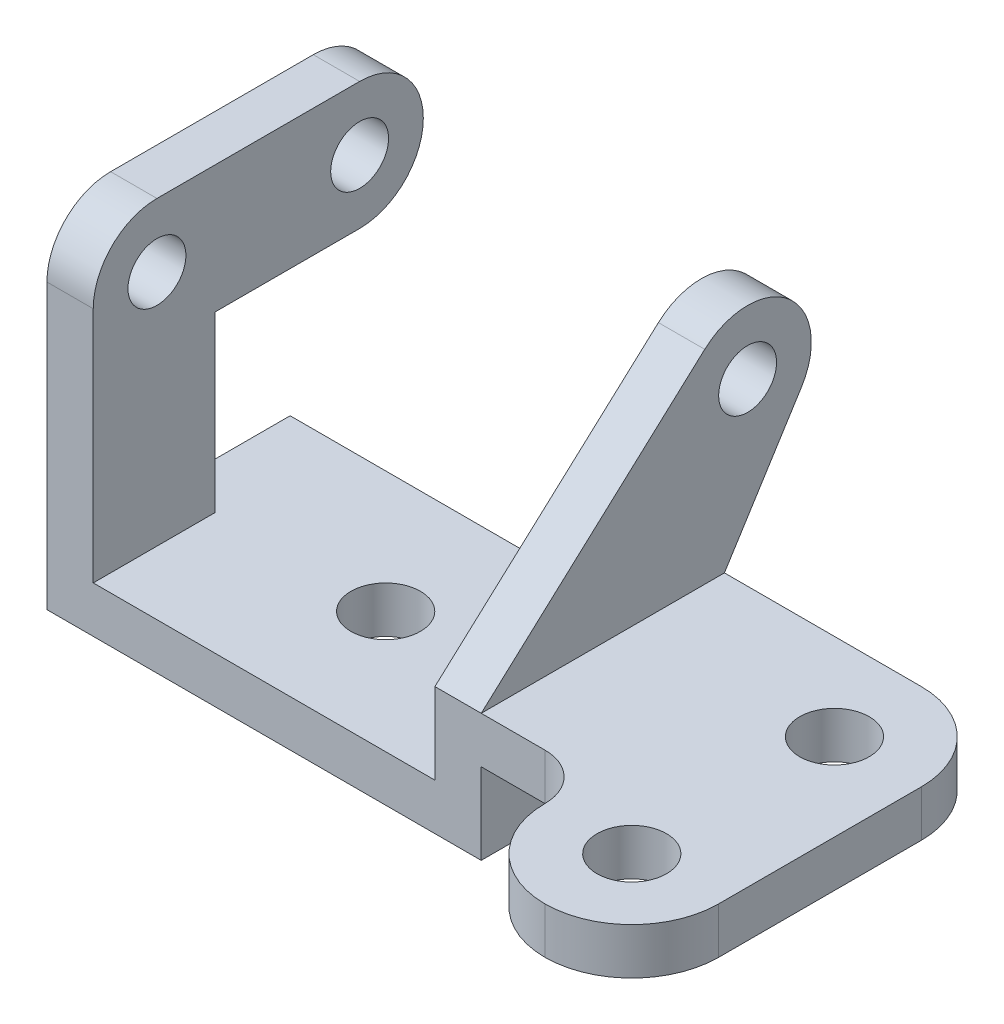
ISO-10303-21;
HEADER;
FILE_DESCRIPTION(('STEP AP214'),'2;1');
FILE_NAME('part.step','',(''),(''),'','','');
FILE_SCHEMA(('AUTOMOTIVE_DESIGN { 1 0 10303 214 1 1 1 1 }'));
ENDSEC;
DATA;
#1=APPLICATION_CONTEXT('core data for automotive mechanical design processes');
#2=APPLICATION_PROTOCOL_DEFINITION('international standard','automotive_design',2000,#1);
#3=PRODUCT_CONTEXT('',#1,'mechanical');
#4=PRODUCT('Part','Part','',(#3));
#5=PRODUCT_RELATED_PRODUCT_CATEGORY('part','',(#4));
#6=PRODUCT_DEFINITION_FORMATION('','',#4);
#7=PRODUCT_DEFINITION_CONTEXT('part definition',#1,'design');
#8=PRODUCT_DEFINITION('design','',#6,#7);
#9=PRODUCT_DEFINITION_SHAPE('','',#8);
#10=(LENGTH_UNIT() NAMED_UNIT(*) SI_UNIT(.MILLI.,.METRE.));
#11=(NAMED_UNIT(*) PLANE_ANGLE_UNIT() SI_UNIT($,.RADIAN.));
#12=(NAMED_UNIT(*) SI_UNIT($,.STERADIAN.) SOLID_ANGLE_UNIT());
#13=UNCERTAINTY_MEASURE_WITH_UNIT(LENGTH_MEASURE(1.E-05),#10,'distance_accuracy_value','');
#14=(GEOMETRIC_REPRESENTATION_CONTEXT(3) GLOBAL_UNCERTAINTY_ASSIGNED_CONTEXT((#13)) GLOBAL_UNIT_ASSIGNED_CONTEXT((#10,
#11,#12)) REPRESENTATION_CONTEXT('',''));
#15=CARTESIAN_POINT('',(0.,0.,0.));
#16=DIRECTION('',(0.,0.,1.));
#17=DIRECTION('',(1.,0.,0.));
#18=AXIS2_PLACEMENT_3D('',#15,#16,#17);
#19=CARTESIAN_POINT('',(-75.,120.,0.));
#20=DIRECTION('',(0.,0.,1.));
#21=DIRECTION('',(1.,0.,0.));
#22=AXIS2_PLACEMENT_3D('',#19,#20,#21);
#23=PLANE('',#22);
#24=DIRECTION('',(-1.,0.,0.));
#25=VECTOR('',#24,1.);
#26=CARTESIAN_POINT('',(-59.,76.,0.));
#27=LINE('',#26,#25);
#28=CARTESIAN_POINT('',(-59.,76.,0.));
#29=VERTEX_POINT('',#28);
#30=CARTESIAN_POINT('',(-75.,76.,0.));
#31=VERTEX_POINT('',#30);
#32=EDGE_CURVE('E207',#29,#31,#27,.T.);
#33=ORIENTED_EDGE('',*,*,#32,.F.);
#34=DIRECTION('',(0.,-1.,0.));
#35=VECTOR('',#34,1.);
#36=CARTESIAN_POINT('',(-59.,120.,0.));
#37=LINE('',#36,#35);
#38=CARTESIAN_POINT('',(-59.,16.,0.));
#39=VERTEX_POINT('',#38);
#40=EDGE_CURVE('E219',#29,#39,#37,.T.);
#41=ORIENTED_EDGE('',*,*,#40,.T.);
#42=DIRECTION('',(-1.,0.,0.));
#43=VECTOR('',#42,1.);
#44=CARTESIAN_POINT('',(-75.,16.,0.));
#45=LINE('',#44,#43);
#46=CARTESIAN_POINT('',(-75.,16.,0.));
#47=VERTEX_POINT('',#46);
#48=EDGE_CURVE('E603',#39,#47,#45,.T.);
#49=ORIENTED_EDGE('',*,*,#48,.T.);
#50=DIRECTION('',(0.,-1.,0.));
#51=VECTOR('',#50,1.);
#52=CARTESIAN_POINT('',(-75.,120.,0.));
#53=LINE('',#52,#51);
#54=EDGE_CURVE('E221',#31,#47,#53,.T.);
#55=ORIENTED_EDGE('',*,*,#54,.F.);
#56=EDGE_LOOP('',(#33,#41,#49,#55));
#57=FACE_BOUND('',#56,.T.);
#58=ADVANCED_FACE('F57',(#57),#23,.F.);
#59=CARTESIAN_POINT('',(0.,16.,0.));
#60=DIRECTION('',(0.,-1.,0.));
#61=DIRECTION('',(0.,0.,-1.));
#62=AXIS2_PLACEMENT_3D('',#59,#60,#61);
#63=PLANE('',#62);
#64=CARTESIAN_POINT('',(0.,16.,0.));
#65=DIRECTION('',(0.,1.,0.));
#66=DIRECTION('',(0.,0.,1.));
#67=AXIS2_PLACEMENT_3D('',#64,#65,#66);
#68=CIRCLE('',#67,12.);
#69=CARTESIAN_POINT('',(0.,16.,12.));
#70=VERTEX_POINT('',#69);
#71=EDGE_CURVE('E343',#70,#70,#68,.T.);
#72=ORIENTED_EDGE('',*,*,#71,.F.);
#73=EDGE_LOOP('',(#72));
#74=FACE_BOUND('',#73,.T.);
#75=DIRECTION('',(0.,0.,-1.));
#76=VECTOR('',#75,1.);
#77=CARTESIAN_POINT('',(-59.,16.,42.));
#78=LINE('',#77,#76);
#79=CARTESIAN_POINT('',(-59.,16.,42.));
#80=VERTEX_POINT('',#79);
#81=EDGE_CURVE('E228',#80,#39,#78,.T.);
#82=ORIENTED_EDGE('',*,*,#81,.F.);
#83=DIRECTION('',(1.,0.,0.));
#84=VECTOR('',#83,1.);
#85=CARTESIAN_POINT('',(-75.,16.,42.));
#86=LINE('',#85,#84);
#87=CARTESIAN_POINT('',(59.,16.,42.));
#88=VERTEX_POINT('',#87);
#89=EDGE_CURVE('E359',#80,#88,#86,.T.);
#90=ORIENTED_EDGE('',*,*,#89,.T.);
#91=DIRECTION('',(0.,0.,1.));
#92=VECTOR('',#91,1.);
#93=CARTESIAN_POINT('',(59.,16.,42.));
#94=LINE('',#93,#92);
#95=CARTESIAN_POINT('',(59.,16.,-42.));
#96=VERTEX_POINT('',#95);
#97=EDGE_CURVE('E321',#96,#88,#94,.T.);
#98=ORIENTED_EDGE('',*,*,#97,.F.);
#99=DIRECTION('',(-1.,0.,0.));
#100=VECTOR('',#99,1.);
#101=CARTESIAN_POINT('',(-75.,16.,-42.));
#102=LINE('',#101,#100);
#103=CARTESIAN_POINT('',(-75.,16.,-42.));
#104=VERTEX_POINT('',#103);
#105=EDGE_CURVE('E351',#96,#104,#102,.T.);
#106=ORIENTED_EDGE('',*,*,#105,.T.);
#107=DIRECTION('',(0.,0.,1.));
#108=VECTOR('',#107,1.);
#109=CARTESIAN_POINT('',(-75.,16.,42.));
#110=LINE('',#109,#108);
#111=EDGE_CURVE('E354',#104,#47,#110,.T.);
#112=ORIENTED_EDGE('',*,*,#111,.T.);
#113=ORIENTED_EDGE('',*,*,#48,.F.);
#114=EDGE_LOOP('',(#82,#90,#98,#106,#112,#113));
#115=FACE_BOUND('',#114,.T.);
#116=ADVANCED_FACE('F668',(#74,#115),#63,.F.);
#117=CARTESIAN_POINT('',(0.,44.,0.));
#118=DIRECTION('',(0.,1.,0.));
#119=DIRECTION('',(0.,0.,1.));
#120=AXIS2_PLACEMENT_3D('',#117,#118,#119);
#121=PLANE('',#120);
#122=CARTESIAN_POINT('',(143.,44.,-12.));
#123=DIRECTION('',(0.,1.,0.));
#124=DIRECTION('',(0.,0.,1.));
#125=AXIS2_PLACEMENT_3D('',#122,#123,#124);
#126=CIRCLE('',#125,12.);
#127=CARTESIAN_POINT('',(143.,44.,0.));
#128=VERTEX_POINT('',#127);
#129=EDGE_CURVE('E287',#128,#128,#126,.T.);
#130=ORIENTED_EDGE('',*,*,#129,.F.);
#131=EDGE_LOOP('',(#130));
#132=FACE_BOUND('',#131,.T.);
#133=CARTESIAN_POINT('',(143.,44.,58.));
#134=DIRECTION('',(0.,1.,0.));
#135=DIRECTION('',(0.,0.,1.));
#136=AXIS2_PLACEMENT_3D('',#133,#134,#135);
#137=CIRCLE('',#136,12.);
#138=CARTESIAN_POINT('',(143.,44.,70.));
#139=VERTEX_POINT('',#138);
#140=EDGE_CURVE('E292',#139,#139,#137,.T.);
#141=ORIENTED_EDGE('',*,*,#140,.F.);
#142=EDGE_LOOP('',(#141));
#143=FACE_BOUND('',#142,.T.);
#144=DIRECTION('',(-1.,0.,0.));
#145=VECTOR('',#144,1.);
#146=CARTESIAN_POINT('',(75.,44.,-42.));
#147=LINE('',#146,#145);
#148=CARTESIAN_POINT('',(143.,44.,-42.));
#149=VERTEX_POINT('',#148);
#150=CARTESIAN_POINT('',(75.,44.,-42.));
#151=VERTEX_POINT('',#150);
#152=EDGE_CURVE('E322',#149,#151,#147,.T.);
#153=ORIENTED_EDGE('',*,*,#152,.T.);
#154=DIRECTION('',(0.,0.,1.));
#155=VECTOR('',#154,1.);
#156=CARTESIAN_POINT('',(75.,44.,-42.));
#157=LINE('',#156,#155);
#158=CARTESIAN_POINT('',(75.,44.,42.));
#159=VERTEX_POINT('',#158);
#160=EDGE_CURVE('E250',#151,#159,#157,.T.);
#161=ORIENTED_EDGE('',*,*,#160,.T.);
#162=DIRECTION('',(1.,0.,0.));
#163=VECTOR('',#162,1.);
#164=CARTESIAN_POINT('',(75.,44.,42.));
#165=LINE('',#164,#163);
#166=CARTESIAN_POINT('',(97.,44.,42.));
#167=VERTEX_POINT('',#166);
#168=EDGE_CURVE('E326',#159,#167,#165,.T.);
#169=ORIENTED_EDGE('',*,*,#168,.T.);
#170=CARTESIAN_POINT('',(97.,44.,58.));
#171=DIRECTION('',(0.,1.,0.));
#172=DIRECTION('',(0.,0.,1.));
#173=AXIS2_PLACEMENT_3D('',#170,#171,#172);
#174=CIRCLE('',#173,16.);
#175=CARTESIAN_POINT('',(113.,44.,58.));
#176=VERTEX_POINT('',#175);
#177=EDGE_CURVE('E431',#167,#176,#174,.F.);
#178=ORIENTED_EDGE('',*,*,#177,.T.);
#179=CARTESIAN_POINT('',(143.,44.,58.));
#180=DIRECTION('',(0.,1.,0.));
#181=DIRECTION('',(0.,0.,1.));
#182=AXIS2_PLACEMENT_3D('',#179,#180,#181);
#183=CIRCLE('',#182,30.);
#184=CARTESIAN_POINT('',(143.,44.,88.));
#185=VERTEX_POINT('',#184);
#186=EDGE_CURVE('E405',#176,#185,#183,.T.);
#187=ORIENTED_EDGE('',*,*,#186,.T.);
#188=CARTESIAN_POINT('',(143.,44.,58.));
#189=DIRECTION('',(0.,1.,0.));
#190=DIRECTION('',(0.,0.,1.));
#191=AXIS2_PLACEMENT_3D('',#188,#189,#190);
#192=CIRCLE('',#191,30.);
#193=CARTESIAN_POINT('',(173.,44.,58.));
#194=VERTEX_POINT('',#193);
#195=EDGE_CURVE('E402',#185,#194,#192,.T.);
#196=ORIENTED_EDGE('',*,*,#195,.T.);
#197=DIRECTION('',(0.,0.,1.));
#198=VECTOR('',#197,1.);
#199=CARTESIAN_POINT('',(173.,44.,42.));
#200=LINE('',#199,#198);
#201=CARTESIAN_POINT('',(173.,44.,-12.));
#202=VERTEX_POINT('',#201);
#203=EDGE_CURVE('E307',#202,#194,#200,.T.);
#204=ORIENTED_EDGE('',*,*,#203,.F.);
#205=CARTESIAN_POINT('',(143.,44.,-12.));
#206=DIRECTION('',(0.,1.,0.));
#207=DIRECTION('',(0.,0.,1.));
#208=AXIS2_PLACEMENT_3D('',#205,#206,#207);
#209=CIRCLE('',#208,30.);
#210=EDGE_CURVE('E408',#202,#149,#209,.T.);
#211=ORIENTED_EDGE('',*,*,#210,.T.);
#212=EDGE_LOOP('',(#153,#161,#169,#178,#187,#196,#204,#211));
#213=FACE_BOUND('',#212,.T.);
#214=ADVANCED_FACE('F707',(#132,#143,#213),#121,.T.);
#215=CARTESIAN_POINT('',(-75.,16.,42.));
#216=DIRECTION('',(0.,0.,-1.));
#217=DIRECTION('',(-1.,0.,0.));
#218=AXIS2_PLACEMENT_3D('',#215,#216,#217);
#219=PLANE('',#218);
#220=DIRECTION('',(0.,-1.,0.));
#221=VECTOR('',#220,1.);
#222=CARTESIAN_POINT('',(-59.,120.,42.));
#223=LINE('',#222,#221);
#224=CARTESIAN_POINT('',(-59.,98.,42.));
#225=VERTEX_POINT('',#224);
#226=EDGE_CURVE('E230',#225,#80,#223,.T.);
#227=ORIENTED_EDGE('',*,*,#226,.F.);
#228=DIRECTION('',(1.,0.,0.));
#229=VECTOR('',#228,1.);
#230=CARTESIAN_POINT('',(-75.,98.,42.));
#231=LINE('',#230,#229);
#232=CARTESIAN_POINT('',(-75.,98.,42.));
#233=VERTEX_POINT('',#232);
#234=EDGE_CURVE('E441',#225,#233,#231,.F.);
#235=ORIENTED_EDGE('',*,*,#234,.T.);
#236=DIRECTION('',(0.,-1.,0.));
#237=VECTOR('',#236,1.);
#238=CARTESIAN_POINT('',(-75.,16.,42.));
#239=LINE('',#238,#237);
#240=CARTESIAN_POINT('',(-75.,0.,42.));
#241=VERTEX_POINT('',#240);
#242=EDGE_CURVE('E378',#233,#241,#239,.T.);
#243=ORIENTED_EDGE('',*,*,#242,.T.);
#244=DIRECTION('',(1.,0.,0.));
#245=VECTOR('',#244,1.);
#246=CARTESIAN_POINT('',(-75.,0.,42.));
#247=LINE('',#246,#245);
#248=CARTESIAN_POINT('',(75.,0.,42.));
#249=VERTEX_POINT('',#248);
#250=EDGE_CURVE('E355',#241,#249,#247,.T.);
#251=ORIENTED_EDGE('',*,*,#250,.T.);
#252=DIRECTION('',(0.,-1.,0.));
#253=VECTOR('',#252,1.);
#254=CARTESIAN_POINT('',(75.,16.,42.));
#255=LINE('',#254,#253);
#256=CARTESIAN_POINT('',(75.,28.,42.));
#257=VERTEX_POINT('',#256);
#258=EDGE_CURVE('E362',#257,#249,#255,.T.);
#259=ORIENTED_EDGE('',*,*,#258,.F.);
#260=DIRECTION('',(-1.,0.,0.));
#261=VECTOR('',#260,1.);
#262=CARTESIAN_POINT('',(173.,28.,42.));
#263=LINE('',#262,#261);
#264=CARTESIAN_POINT('',(97.,28.,42.));
#265=VERTEX_POINT('',#264);
#266=EDGE_CURVE('E318',#265,#257,#263,.T.);
#267=ORIENTED_EDGE('',*,*,#266,.F.);
#268=DIRECTION('',(0.,-1.,0.));
#269=VECTOR('',#268,1.);
#270=CARTESIAN_POINT('',(97.,44.,42.));
#271=LINE('',#270,#269);
#272=EDGE_CURVE('E421',#265,#167,#271,.F.);
#273=ORIENTED_EDGE('',*,*,#272,.T.);
#274=ORIENTED_EDGE('',*,*,#168,.F.);
#275=CARTESIAN_POINT('',(59.,44.,42.));
#276=VERTEX_POINT('',#275);
#277=EDGE_CURVE('E327',#276,#159,#165,.T.);
#278=ORIENTED_EDGE('',*,*,#277,.F.);
#279=DIRECTION('',(0.,-1.,0.));
#280=VECTOR('',#279,1.);
#281=CARTESIAN_POINT('',(59.,44.,42.));
#282=LINE('',#281,#280);
#283=EDGE_CURVE('E331',#276,#88,#282,.T.);
#284=ORIENTED_EDGE('',*,*,#283,.T.);
#285=ORIENTED_EDGE('',*,*,#89,.F.);
#286=EDGE_LOOP('',(#227,#235,#243,#251,#259,#267,#273,#274,#278,#284,#285));
#287=FACE_BOUND('',#286,.T.);
#288=ADVANCED_FACE('F663',(#287),#219,.F.);
#289=CARTESIAN_POINT('',(75.,16.,42.));
#290=DIRECTION('',(-1.,0.,0.));
#291=DIRECTION('',(0.,0.,1.));
#292=AXIS2_PLACEMENT_3D('',#289,#290,#291);
#293=PLANE('',#292);
#294=DIRECTION('',(0.,0.,-1.));
#295=VECTOR('',#294,1.);
#296=CARTESIAN_POINT('',(75.,28.,42.));
#297=LINE('',#296,#295);
#298=CARTESIAN_POINT('',(75.,28.,-42.));
#299=VERTEX_POINT('',#298);
#300=EDGE_CURVE('E308',#257,#299,#297,.T.);
#301=ORIENTED_EDGE('',*,*,#300,.F.);
#302=ORIENTED_EDGE('',*,*,#258,.T.);
#303=DIRECTION('',(0.,0.,-1.));
#304=VECTOR('',#303,1.);
#305=CARTESIAN_POINT('',(75.,0.,42.));
#306=LINE('',#305,#304);
#307=CARTESIAN_POINT('',(75.,0.,-42.));
#308=VERTEX_POINT('',#307);
#309=EDGE_CURVE('E347',#249,#308,#306,.T.);
#310=ORIENTED_EDGE('',*,*,#309,.T.);
#311=DIRECTION('',(0.,-1.,0.));
#312=VECTOR('',#311,1.);
#313=CARTESIAN_POINT('',(75.,16.,-42.));
#314=LINE('',#313,#312);
#315=EDGE_CURVE('E385',#299,#308,#314,.T.);
#316=ORIENTED_EDGE('',*,*,#315,.F.);
#317=EDGE_LOOP('',(#301,#302,#310,#316));
#318=FACE_BOUND('',#317,.T.);
#319=ADVANCED_FACE('F694',(#318),#293,.F.);
#320=CARTESIAN_POINT('',(0.,0.,0.));
#321=DIRECTION('',(0.,-1.,0.));
#322=DIRECTION('',(0.,0.,-1.));
#323=AXIS2_PLACEMENT_3D('',#320,#321,#322);
#324=PLANE('',#323);
#325=ORIENTED_EDGE('',*,*,#309,.F.);
#326=ORIENTED_EDGE('',*,*,#250,.F.);
#327=DIRECTION('',(0.,0.,1.));
#328=VECTOR('',#327,1.);
#329=CARTESIAN_POINT('',(-75.,0.,42.));
#330=LINE('',#329,#328);
#331=CARTESIAN_POINT('',(-75.,0.,-42.));
#332=VERTEX_POINT('',#331);
#333=EDGE_CURVE('E369',#332,#241,#330,.T.);
#334=ORIENTED_EDGE('',*,*,#333,.F.);
#335=DIRECTION('',(-1.,0.,0.));
#336=VECTOR('',#335,1.);
#337=CARTESIAN_POINT('',(-75.,0.,-42.));
#338=LINE('',#337,#336);
#339=EDGE_CURVE('E366',#308,#332,#338,.T.);
#340=ORIENTED_EDGE('',*,*,#339,.F.);
#341=EDGE_LOOP('',(#325,#326,#334,#340));
#342=FACE_BOUND('',#341,.T.);
#343=CARTESIAN_POINT('',(0.,0.,0.));
#344=DIRECTION('',(0.,1.,0.));
#345=DIRECTION('',(0.,0.,1.));
#346=AXIS2_PLACEMENT_3D('',#343,#344,#345);
#347=CIRCLE('',#346,12.);
#348=CARTESIAN_POINT('',(0.,0.,12.));
#349=VERTEX_POINT('',#348);
#350=EDGE_CURVE('E342',#349,#349,#347,.T.);
#351=ORIENTED_EDGE('',*,*,#350,.T.);
#352=EDGE_LOOP('',(#351));
#353=FACE_BOUND('',#352,.T.);
#354=ADVANCED_FACE('F687',(#342,#353),#324,.T.);
#355=CARTESIAN_POINT('',(-75.,16.,-42.));
#356=DIRECTION('',(0.,0.,1.));
#357=DIRECTION('',(1.,0.,0.));
#358=AXIS2_PLACEMENT_3D('',#355,#356,#357);
#359=PLANE('',#358);
#360=ORIENTED_EDGE('',*,*,#152,.F.);
#361=DIRECTION('',(0.,1.,0.));
#362=VECTOR('',#361,1.);
#363=CARTESIAN_POINT('',(143.,28.,-42.));
#364=LINE('',#363,#362);
#365=CARTESIAN_POINT('',(143.,28.,-42.));
#366=VERTEX_POINT('',#365);
#367=EDGE_CURVE('E418',#149,#366,#364,.F.);
#368=ORIENTED_EDGE('',*,*,#367,.T.);
#369=DIRECTION('',(-1.,0.,0.));
#370=VECTOR('',#369,1.);
#371=CARTESIAN_POINT('',(173.,28.,-42.));
#372=LINE('',#371,#370);
#373=EDGE_CURVE('E312',#366,#299,#372,.T.);
#374=ORIENTED_EDGE('',*,*,#373,.T.);
#375=ORIENTED_EDGE('',*,*,#315,.T.);
#376=ORIENTED_EDGE('',*,*,#339,.T.);
#377=DIRECTION('',(0.,-1.,0.));
#378=VECTOR('',#377,1.);
#379=CARTESIAN_POINT('',(-75.,16.,-42.));
#380=LINE('',#379,#378);
#381=EDGE_CURVE('E381',#104,#332,#380,.T.);
#382=ORIENTED_EDGE('',*,*,#381,.F.);
#383=ORIENTED_EDGE('',*,*,#105,.F.);
#384=DIRECTION('',(0.,-1.,0.));
#385=VECTOR('',#384,1.);
#386=CARTESIAN_POINT('',(59.,44.,-42.));
#387=LINE('',#386,#385);
#388=CARTESIAN_POINT('',(59.,44.,-42.));
#389=VERTEX_POINT('',#388);
#390=EDGE_CURVE('E338',#389,#96,#387,.T.);
#391=ORIENTED_EDGE('',*,*,#390,.F.);
#392=DIRECTION('',(-1.,0.,0.));
#393=VECTOR('',#392,1.);
#394=CARTESIAN_POINT('',(75.,44.,-42.));
#395=LINE('',#394,#393);
#396=EDGE_CURVE('E278',#151,#389,#395,.T.);
#397=ORIENTED_EDGE('',*,*,#396,.F.);
#398=EDGE_LOOP('',(#360,#368,#374,#375,#376,#382,#383,#391,#397));
#399=FACE_BOUND('',#398,.T.);
#400=ADVANCED_FACE('F678',(#399),#359,.F.);
#401=CARTESIAN_POINT('',(-75.,16.,42.));
#402=DIRECTION('',(1.,0.,0.));
#403=DIRECTION('',(0.,0.,-1.));
#404=AXIS2_PLACEMENT_3D('',#401,#402,#403);
#405=PLANE('',#404);
#406=CARTESIAN_POINT('',(-75.,98.,-50.));
#407=DIRECTION('',(-1.,0.,0.));
#408=DIRECTION('',(0.,0.,1.));
#409=AXIS2_PLACEMENT_3D('',#406,#407,#408);
#410=CIRCLE('',#409,10.);
#411=CARTESIAN_POINT('',(-75.,98.,-40.));
#412=VERTEX_POINT('',#411);
#413=EDGE_CURVE('E635',#412,#412,#410,.T.);
#414=ORIENTED_EDGE('',*,*,#413,.F.);
#415=EDGE_LOOP('',(#414));
#416=FACE_BOUND('',#415,.T.);
#417=CARTESIAN_POINT('',(-75.,98.,20.));
#418=DIRECTION('',(-1.,0.,0.));
#419=DIRECTION('',(0.,0.,1.));
#420=AXIS2_PLACEMENT_3D('',#417,#418,#419);
#421=CIRCLE('',#420,10.);
#422=CARTESIAN_POINT('',(-75.,98.,30.));
#423=VERTEX_POINT('',#422);
#424=EDGE_CURVE('E214',#423,#423,#421,.T.);
#425=ORIENTED_EDGE('',*,*,#424,.F.);
#426=EDGE_LOOP('',(#425));
#427=FACE_BOUND('',#426,.T.);
#428=DIRECTION('',(0.,0.,1.));
#429=VECTOR('',#428,1.);
#430=CARTESIAN_POINT('',(-75.,120.,42.));
#431=LINE('',#430,#429);
#432=CARTESIAN_POINT('',(-75.,120.,-50.));
#433=VERTEX_POINT('',#432);
#434=CARTESIAN_POINT('',(-75.,120.,20.));
#435=VERTEX_POINT('',#434);
#436=EDGE_CURVE('E598',#433,#435,#431,.T.);
#437=ORIENTED_EDGE('',*,*,#436,.F.);
#438=CARTESIAN_POINT('',(-75.,98.,-50.));
#439=DIRECTION('',(1.,0.,0.));
#440=DIRECTION('',(0.,0.,-1.));
#441=AXIS2_PLACEMENT_3D('',#438,#439,#440);
#442=CIRCLE('',#441,22.);
#443=CARTESIAN_POINT('',(-75.,98.,-72.));
#444=VERTEX_POINT('',#443);
#445=EDGE_CURVE('E67',#433,#444,#442,.F.);
#446=ORIENTED_EDGE('',*,*,#445,.T.);
#447=CARTESIAN_POINT('',(-75.,98.,-50.));
#448=DIRECTION('',(1.,0.,0.));
#449=DIRECTION('',(0.,0.,-1.));
#450=AXIS2_PLACEMENT_3D('',#447,#448,#449);
#451=CIRCLE('',#450,22.);
#452=CARTESIAN_POINT('',(-75.,76.,-50.));
#453=VERTEX_POINT('',#452);
#454=EDGE_CURVE('E74',#444,#453,#451,.F.);
#455=ORIENTED_EDGE('',*,*,#454,.T.);
#456=DIRECTION('',(0.,0.,1.));
#457=VECTOR('',#456,1.);
#458=CARTESIAN_POINT('',(-75.,76.,-72.));
#459=LINE('',#458,#457);
#460=EDGE_CURVE('E215',#453,#31,#459,.T.);
#461=ORIENTED_EDGE('',*,*,#460,.T.);
#462=ORIENTED_EDGE('',*,*,#54,.T.);
#463=ORIENTED_EDGE('',*,*,#111,.F.);
#464=ORIENTED_EDGE('',*,*,#381,.T.);
#465=ORIENTED_EDGE('',*,*,#333,.T.);
#466=ORIENTED_EDGE('',*,*,#242,.F.);
#467=CARTESIAN_POINT('',(-75.,98.,20.));
#468=DIRECTION('',(1.,0.,0.));
#469=DIRECTION('',(0.,0.,-1.));
#470=AXIS2_PLACEMENT_3D('',#467,#468,#469);
#471=CIRCLE('',#470,22.);
#472=EDGE_CURVE('E444',#233,#435,#471,.F.);
#473=ORIENTED_EDGE('',*,*,#472,.T.);
#474=EDGE_LOOP('',(#437,#446,#455,#461,#462,#463,#464,#465,#466,#473));
#475=FACE_BOUND('',#474,.T.);
#476=ADVANCED_FACE('F681',(#416,#427,#475),#405,.F.);
#477=CARTESIAN_POINT('',(0.,16.,0.));
#478=DIRECTION('',(0.,-1.,0.));
#479=DIRECTION('',(0.,0.,-1.));
#480=AXIS2_PLACEMENT_3D('',#477,#478,#479);
#481=CYLINDRICAL_SURFACE('',#480,12.);
#482=ORIENTED_EDGE('',*,*,#71,.T.);
#483=EDGE_LOOP('',(#482));
#484=FACE_BOUND('',#483,.T.);
#485=ORIENTED_EDGE('',*,*,#350,.F.);
#486=EDGE_LOOP('',(#485));
#487=FACE_BOUND('',#486,.T.);
#488=ADVANCED_FACE('F774',(#484,#487),#481,.F.);
#489=CARTESIAN_POINT('',(59.,44.,42.));
#490=DIRECTION('',(1.,0.,0.));
#491=DIRECTION('',(0.,0.,-1.));
#492=AXIS2_PLACEMENT_3D('',#489,#490,#491);
#493=PLANE('',#492);
#494=ORIENTED_EDGE('',*,*,#97,.T.);
#495=ORIENTED_EDGE('',*,*,#283,.F.);
#496=DIRECTION('',(0.,0.673174953207588,-0.739483253612928));
#497=VECTOR('',#496,1.);
#498=CARTESIAN_POINT('',(59.,44.,42.));
#499=LINE('',#498,#497);
#500=CARTESIAN_POINT('',(59.,114.268631579484,-35.1901510294331));
#501=VERTEX_POINT('',#500);
#502=EDGE_CURVE('E246',#276,#501,#499,.T.);
#503=ORIENTED_EDGE('',*,*,#502,.T.);
#504=CARTESIAN_POINT('',(59.,98.,-50.));
#505=DIRECTION('',(-1.,0.,0.));
#506=DIRECTION('',(0.,0.,1.));
#507=AXIS2_PLACEMENT_3D('',#504,#505,#506);
#508=CIRCLE('',#507,22.);
#509=CARTESIAN_POINT('',(59.,86.2788734289446,-68.6176043546236));
#510=VERTEX_POINT('',#509);
#511=EDGE_CURVE('E271',#501,#510,#508,.T.);
#512=ORIENTED_EDGE('',*,*,#511,.T.);
#513=DIRECTION('',(0.,-0.846254743391983,0.532778480502516));
#514=VECTOR('',#513,1.);
#515=CARTESIAN_POINT('',(59.,44.,-42.));
#516=LINE('',#515,#514);
#517=EDGE_CURVE('E255',#510,#389,#516,.T.);
#518=ORIENTED_EDGE('',*,*,#517,.T.);
#519=ORIENTED_EDGE('',*,*,#390,.T.);
#520=EDGE_LOOP('',(#494,#495,#503,#512,#518,#519));
#521=FACE_BOUND('',#520,.T.);
#522=CARTESIAN_POINT('',(59.,98.,-50.));
#523=DIRECTION('',(-1.,0.,0.));
#524=DIRECTION('',(0.,0.,1.));
#525=AXIS2_PLACEMENT_3D('',#522,#523,#524);
#526=CIRCLE('',#525,10.);
#527=CARTESIAN_POINT('',(59.,98.,-40.));
#528=VERTEX_POINT('',#527);
#529=EDGE_CURVE('E236',#528,#528,#526,.T.);
#530=ORIENTED_EDGE('',*,*,#529,.F.);
#531=EDGE_LOOP('',(#530));
#532=FACE_BOUND('',#531,.T.);
#533=ADVANCED_FACE('F671',(#521,#532),#493,.F.);
#534=CARTESIAN_POINT('',(173.,28.,42.));
#535=DIRECTION('',(0.,1.,0.));
#536=DIRECTION('',(0.,0.,1.));
#537=AXIS2_PLACEMENT_3D('',#534,#535,#536);
#538=PLANE('',#537);
#539=CARTESIAN_POINT('',(143.,28.,-12.));
#540=DIRECTION('',(0.,1.,0.));
#541=DIRECTION('',(0.,0.,1.));
#542=AXIS2_PLACEMENT_3D('',#539,#540,#541);
#543=CIRCLE('',#542,12.);
#544=CARTESIAN_POINT('',(143.,28.,0.));
#545=VERTEX_POINT('',#544);
#546=EDGE_CURVE('E291',#545,#545,#543,.F.);
#547=ORIENTED_EDGE('',*,*,#546,.F.);
#548=EDGE_LOOP('',(#547));
#549=FACE_BOUND('',#548,.T.);
#550=CARTESIAN_POINT('',(143.,28.,58.));
#551=DIRECTION('',(0.,1.,0.));
#552=DIRECTION('',(0.,0.,1.));
#553=AXIS2_PLACEMENT_3D('',#550,#551,#552);
#554=CIRCLE('',#553,12.);
#555=CARTESIAN_POINT('',(143.,28.,70.));
#556=VERTEX_POINT('',#555);
#557=EDGE_CURVE('E281',#556,#556,#554,.F.);
#558=ORIENTED_EDGE('',*,*,#557,.F.);
#559=EDGE_LOOP('',(#558));
#560=FACE_BOUND('',#559,.T.);
#561=ORIENTED_EDGE('',*,*,#373,.F.);
#562=CARTESIAN_POINT('',(143.,28.,-12.));
#563=DIRECTION('',(0.,1.,0.));
#564=DIRECTION('',(0.,0.,1.));
#565=AXIS2_PLACEMENT_3D('',#562,#563,#564);
#566=CIRCLE('',#565,30.);
#567=CARTESIAN_POINT('',(173.,28.,-12.));
#568=VERTEX_POINT('',#567);
#569=EDGE_CURVE('E395',#366,#568,#566,.F.);
#570=ORIENTED_EDGE('',*,*,#569,.T.);
#571=DIRECTION('',(0.,0.,-1.));
#572=VECTOR('',#571,1.);
#573=CARTESIAN_POINT('',(173.,28.,42.));
#574=LINE('',#573,#572);
#575=CARTESIAN_POINT('',(173.,28.,58.));
#576=VERTEX_POINT('',#575);
#577=EDGE_CURVE('E303',#576,#568,#574,.T.);
#578=ORIENTED_EDGE('',*,*,#577,.F.);
#579=CARTESIAN_POINT('',(143.,28.,58.));
#580=DIRECTION('',(0.,1.,0.));
#581=DIRECTION('',(0.,0.,1.));
#582=AXIS2_PLACEMENT_3D('',#579,#580,#581);
#583=CIRCLE('',#582,30.);
#584=CARTESIAN_POINT('',(143.,28.,88.));
#585=VERTEX_POINT('',#584);
#586=EDGE_CURVE('E388',#576,#585,#583,.F.);
#587=ORIENTED_EDGE('',*,*,#586,.T.);
#588=CARTESIAN_POINT('',(143.,28.,58.));
#589=DIRECTION('',(0.,1.,0.));
#590=DIRECTION('',(0.,0.,1.));
#591=AXIS2_PLACEMENT_3D('',#588,#589,#590);
#592=CIRCLE('',#591,30.);
#593=CARTESIAN_POINT('',(113.,28.,58.));
#594=VERTEX_POINT('',#593);
#595=EDGE_CURVE('E391',#585,#594,#592,.F.);
#596=ORIENTED_EDGE('',*,*,#595,.T.);
#597=CARTESIAN_POINT('',(97.,28.,58.));
#598=DIRECTION('',(0.,1.,0.));
#599=DIRECTION('',(0.,0.,1.));
#600=AXIS2_PLACEMENT_3D('',#597,#598,#599);
#601=CIRCLE('',#600,16.);
#602=EDGE_CURVE('E428',#594,#265,#601,.T.);
#603=ORIENTED_EDGE('',*,*,#602,.T.);
#604=ORIENTED_EDGE('',*,*,#266,.T.);
#605=ORIENTED_EDGE('',*,*,#300,.T.);
#606=EDGE_LOOP('',(#561,#570,#578,#587,#596,#603,#604,#605));
#607=FACE_BOUND('',#606,.T.);
#608=ADVANCED_FACE('F698',(#549,#560,#607),#538,.F.);
#609=CARTESIAN_POINT('',(173.,0.,0.));
#610=DIRECTION('',(1.,0.,0.));
#611=DIRECTION('',(0.,0.,-1.));
#612=AXIS2_PLACEMENT_3D('',#609,#610,#611);
#613=PLANE('',#612);
#614=ORIENTED_EDGE('',*,*,#577,.T.);
#615=DIRECTION('',(0.,1.,0.));
#616=VECTOR('',#615,1.);
#617=CARTESIAN_POINT('',(173.,44.,-12.));
#618=LINE('',#617,#616);
#619=EDGE_CURVE('E414',#568,#202,#618,.T.);
#620=ORIENTED_EDGE('',*,*,#619,.T.);
#621=ORIENTED_EDGE('',*,*,#203,.T.);
#622=DIRECTION('',(0.,1.,0.));
#623=VECTOR('',#622,1.);
#624=CARTESIAN_POINT('',(173.,0.,58.));
#625=LINE('',#624,#623);
#626=EDGE_CURVE('E411',#194,#576,#625,.F.);
#627=ORIENTED_EDGE('',*,*,#626,.T.);
#628=EDGE_LOOP('',(#614,#620,#621,#627));
#629=FACE_BOUND('',#628,.T.);
#630=ADVANCED_FACE('F761',(#629),#613,.T.);
#631=CARTESIAN_POINT('',(143.,0.,58.));
#632=DIRECTION('',(0.,1.,0.));
#633=DIRECTION('',(0.,0.,1.));
#634=AXIS2_PLACEMENT_3D('',#631,#632,#633);
#635=CYLINDRICAL_SURFACE('',#634,30.);
#636=ORIENTED_EDGE('',*,*,#626,.F.);
#637=ORIENTED_EDGE('',*,*,#195,.F.);
#638=DIRECTION('',(0.,1.,0.));
#639=VECTOR('',#638,1.);
#640=CARTESIAN_POINT('',(143.,0.,88.));
#641=LINE('',#640,#639);
#642=EDGE_CURVE('E296',#585,#185,#641,.T.);
#643=ORIENTED_EDGE('',*,*,#642,.F.);
#644=ORIENTED_EDGE('',*,*,#586,.F.);
#645=EDGE_LOOP('',(#636,#637,#643,#644));
#646=FACE_BOUND('',#645,.T.);
#647=ADVANCED_FACE('F764',(#646),#635,.T.);
#648=CARTESIAN_POINT('',(143.,0.,58.));
#649=DIRECTION('',(0.,1.,0.));
#650=DIRECTION('',(0.,0.,1.));
#651=AXIS2_PLACEMENT_3D('',#648,#649,#650);
#652=CYLINDRICAL_SURFACE('',#651,30.);
#653=ORIENTED_EDGE('',*,*,#186,.F.);
#654=DIRECTION('',(0.,-1.,0.));
#655=VECTOR('',#654,1.);
#656=CARTESIAN_POINT('',(113.,44.,58.));
#657=LINE('',#656,#655);
#658=EDGE_CURVE('E398',#594,#176,#657,.F.);
#659=ORIENTED_EDGE('',*,*,#658,.F.);
#660=ORIENTED_EDGE('',*,*,#595,.F.);
#661=ORIENTED_EDGE('',*,*,#642,.T.);
#662=EDGE_LOOP('',(#653,#659,#660,#661));
#663=FACE_BOUND('',#662,.T.);
#664=ADVANCED_FACE('F789',(#663),#652,.T.);
#665=CARTESIAN_POINT('',(143.,0.,-12.));
#666=DIRECTION('',(0.,-1.,0.));
#667=DIRECTION('',(0.,0.,-1.));
#668=AXIS2_PLACEMENT_3D('',#665,#666,#667);
#669=CYLINDRICAL_SURFACE('',#668,30.);
#670=ORIENTED_EDGE('',*,*,#569,.F.);
#671=ORIENTED_EDGE('',*,*,#367,.F.);
#672=ORIENTED_EDGE('',*,*,#210,.F.);
#673=ORIENTED_EDGE('',*,*,#619,.F.);
#674=EDGE_LOOP('',(#670,#671,#672,#673));
#675=FACE_BOUND('',#674,.T.);
#676=ADVANCED_FACE('F792',(#675),#669,.T.);
#677=CARTESIAN_POINT('',(97.,28.,58.));
#678=DIRECTION('',(0.,1.,0.));
#679=DIRECTION('',(0.,0.,1.));
#680=AXIS2_PLACEMENT_3D('',#677,#678,#679);
#681=CYLINDRICAL_SURFACE('',#680,16.);
#682=ORIENTED_EDGE('',*,*,#177,.F.);
#683=ORIENTED_EDGE('',*,*,#272,.F.);
#684=ORIENTED_EDGE('',*,*,#602,.F.);
#685=ORIENTED_EDGE('',*,*,#658,.T.);
#686=EDGE_LOOP('',(#682,#683,#684,#685));
#687=FACE_BOUND('',#686,.T.);
#688=ADVANCED_FACE('F704',(#687),#681,.F.);
#689=CARTESIAN_POINT('',(143.,-0.001000000000001,58.));
#690=DIRECTION('',(0.,1.,0.));
#691=DIRECTION('',(0.,0.,1.));
#692=AXIS2_PLACEMENT_3D('',#689,#690,#691);
#693=CYLINDRICAL_SURFACE('',#692,12.);
#694=ORIENTED_EDGE('',*,*,#140,.T.);
#695=EDGE_LOOP('',(#694));
#696=FACE_BOUND('',#695,.T.);
#697=ORIENTED_EDGE('',*,*,#557,.T.);
#698=EDGE_LOOP('',(#697));
#699=FACE_BOUND('',#698,.T.);
#700=ADVANCED_FACE('F752',(#696,#699),#693,.F.);
#701=CARTESIAN_POINT('',(143.,-0.001000000000001,-12.));
#702=DIRECTION('',(0.,1.,0.));
#703=DIRECTION('',(0.,0.,1.));
#704=AXIS2_PLACEMENT_3D('',#701,#702,#703);
#705=CYLINDRICAL_SURFACE('',#704,12.);
#706=ORIENTED_EDGE('',*,*,#129,.T.);
#707=EDGE_LOOP('',(#706));
#708=FACE_BOUND('',#707,.T.);
#709=ORIENTED_EDGE('',*,*,#546,.T.);
#710=EDGE_LOOP('',(#709));
#711=FACE_BOUND('',#710,.T.);
#712=ADVANCED_FACE('F748',(#708,#711),#705,.F.);
#713=CARTESIAN_POINT('',(75.,44.,-42.));
#714=DIRECTION('',(0.,-0.532778480502516,-0.846254743391983));
#715=DIRECTION('',(0.,0.846254743391983,-0.532778480502516));
#716=AXIS2_PLACEMENT_3D('',#713,#714,#715);
#717=PLANE('',#716);
#718=ORIENTED_EDGE('',*,*,#517,.F.);
#719=DIRECTION('',(-1.,0.,0.));
#720=VECTOR('',#719,1.);
#721=CARTESIAN_POINT('',(75.,86.2788734289446,-68.6176043546236));
#722=LINE('',#721,#720);
#723=CARTESIAN_POINT('',(75.,86.2788734289446,-68.6176043546236));
#724=VERTEX_POINT('',#723);
#725=EDGE_CURVE('E282',#724,#510,#722,.T.);
#726=ORIENTED_EDGE('',*,*,#725,.F.);
#727=DIRECTION('',(0.,-0.846254743391983,0.532778480502516));
#728=VECTOR('',#727,1.);
#729=CARTESIAN_POINT('',(75.,44.,-42.));
#730=LINE('',#729,#728);
#731=EDGE_CURVE('E263',#724,#151,#730,.T.);
#732=ORIENTED_EDGE('',*,*,#731,.T.);
#733=ORIENTED_EDGE('',*,*,#396,.T.);
#734=EDGE_LOOP('',(#718,#726,#732,#733));
#735=FACE_BOUND('',#734,.T.);
#736=ADVANCED_FACE('F714',(#735),#717,.T.);
#737=CARTESIAN_POINT('',(75.,98.,-50.));
#738=DIRECTION('',(-1.,0.,0.));
#739=DIRECTION('',(0.,0.,1.));
#740=AXIS2_PLACEMENT_3D('',#737,#738,#739);
#741=CYLINDRICAL_SURFACE('',#740,22.);
#742=ORIENTED_EDGE('',*,*,#511,.F.);
#743=DIRECTION('',(-1.,0.,0.));
#744=VECTOR('',#743,1.);
#745=CARTESIAN_POINT('',(75.,114.268631579484,-35.1901510294331));
#746=LINE('',#745,#744);
#747=CARTESIAN_POINT('',(75.,114.268631579484,-35.1901510294331));
#748=VERTEX_POINT('',#747);
#749=EDGE_CURVE('E267',#748,#501,#746,.T.);
#750=ORIENTED_EDGE('',*,*,#749,.F.);
#751=CARTESIAN_POINT('',(75.,98.,-50.));
#752=DIRECTION('',(-1.,0.,0.));
#753=DIRECTION('',(0.,0.,1.));
#754=AXIS2_PLACEMENT_3D('',#751,#752,#753);
#755=CIRCLE('',#754,22.);
#756=EDGE_CURVE('E259',#748,#724,#755,.T.);
#757=ORIENTED_EDGE('',*,*,#756,.T.);
#758=ORIENTED_EDGE('',*,*,#725,.T.);
#759=EDGE_LOOP('',(#742,#750,#757,#758));
#760=FACE_BOUND('',#759,.T.);
#761=ADVANCED_FACE('F717',(#760),#741,.T.);
#762=CARTESIAN_POINT('',(75.,44.,42.));
#763=DIRECTION('',(0.,0.739483253612928,0.673174953207588));
#764=DIRECTION('',(0.,-0.673174953207588,0.739483253612928));
#765=AXIS2_PLACEMENT_3D('',#762,#763,#764);
#766=PLANE('',#765);
#767=ORIENTED_EDGE('',*,*,#502,.F.);
#768=ORIENTED_EDGE('',*,*,#277,.T.);
#769=DIRECTION('',(0.,0.673174953207588,-0.739483253612928));
#770=VECTOR('',#769,1.);
#771=CARTESIAN_POINT('',(75.,44.,42.));
#772=LINE('',#771,#770);
#773=EDGE_CURVE('E254',#159,#748,#772,.T.);
#774=ORIENTED_EDGE('',*,*,#773,.T.);
#775=ORIENTED_EDGE('',*,*,#749,.T.);
#776=EDGE_LOOP('',(#767,#768,#774,#775));
#777=FACE_BOUND('',#776,.T.);
#778=ADVANCED_FACE('F719',(#777),#766,.T.);
#779=CARTESIAN_POINT('',(75.,98.,-50.));
#780=DIRECTION('',(-1.,0.,0.));
#781=DIRECTION('',(0.,0.,1.));
#782=AXIS2_PLACEMENT_3D('',#779,#780,#781);
#783=PLANE('',#782);
#784=CARTESIAN_POINT('',(75.,98.,-50.));
#785=DIRECTION('',(-1.,0.,0.));
#786=DIRECTION('',(0.,0.,1.));
#787=AXIS2_PLACEMENT_3D('',#784,#785,#786);
#788=CIRCLE('',#787,10.);
#789=CARTESIAN_POINT('',(75.,98.,-40.));
#790=VERTEX_POINT('',#789);
#791=EDGE_CURVE('E242',#790,#790,#788,.T.);
#792=ORIENTED_EDGE('',*,*,#791,.T.);
#793=EDGE_LOOP('',(#792));
#794=FACE_BOUND('',#793,.T.);
#795=ORIENTED_EDGE('',*,*,#160,.F.);
#796=ORIENTED_EDGE('',*,*,#731,.F.);
#797=ORIENTED_EDGE('',*,*,#756,.F.);
#798=ORIENTED_EDGE('',*,*,#773,.F.);
#799=EDGE_LOOP('',(#795,#796,#797,#798));
#800=FACE_BOUND('',#799,.T.);
#801=ADVANCED_FACE('F711',(#794,#800),#783,.F.);
#802=CARTESIAN_POINT('',(75.,98.,-50.));
#803=DIRECTION('',(-1.,0.,0.));
#804=DIRECTION('',(0.,0.,1.));
#805=AXIS2_PLACEMENT_3D('',#802,#803,#804);
#806=CYLINDRICAL_SURFACE('',#805,10.);
#807=ORIENTED_EDGE('',*,*,#791,.F.);
#808=EDGE_LOOP('',(#807));
#809=FACE_BOUND('',#808,.T.);
#810=ORIENTED_EDGE('',*,*,#529,.T.);
#811=EDGE_LOOP('',(#810));
#812=FACE_BOUND('',#811,.T.);
#813=ADVANCED_FACE('F726',(#809,#812),#806,.F.);
#814=CARTESIAN_POINT('',(-59.,120.,42.));
#815=DIRECTION('',(-1.,0.,0.));
#816=DIRECTION('',(0.,0.,1.));
#817=AXIS2_PLACEMENT_3D('',#814,#815,#816);
#818=PLANE('',#817);
#819=CARTESIAN_POINT('',(-59.,98.,-50.));
#820=DIRECTION('',(-1.,0.,0.));
#821=DIRECTION('',(0.,0.,1.));
#822=AXIS2_PLACEMENT_3D('',#819,#820,#821);
#823=CIRCLE('',#822,10.);
#824=CARTESIAN_POINT('',(-59.,98.,-40.));
#825=VERTEX_POINT('',#824);
#826=EDGE_CURVE('E223',#825,#825,#823,.F.);
#827=ORIENTED_EDGE('',*,*,#826,.F.);
#828=EDGE_LOOP('',(#827));
#829=FACE_BOUND('',#828,.T.);
#830=CARTESIAN_POINT('',(-59.,98.,20.));
#831=DIRECTION('',(-1.,0.,0.));
#832=DIRECTION('',(0.,0.,1.));
#833=AXIS2_PLACEMENT_3D('',#830,#831,#832);
#834=CIRCLE('',#833,10.);
#835=CARTESIAN_POINT('',(-59.,98.,30.));
#836=VERTEX_POINT('',#835);
#837=EDGE_CURVE('E611',#836,#836,#834,.F.);
#838=ORIENTED_EDGE('',*,*,#837,.F.);
#839=EDGE_LOOP('',(#838));
#840=FACE_BOUND('',#839,.T.);
#841=CARTESIAN_POINT('',(-59.,98.,-50.));
#842=DIRECTION('',(-1.,0.,0.));
#843=DIRECTION('',(0.,0.,1.));
#844=AXIS2_PLACEMENT_3D('',#841,#842,#843);
#845=CIRCLE('',#844,22.);
#846=CARTESIAN_POINT('',(-59.,76.,-50.));
#847=VERTEX_POINT('',#846);
#848=CARTESIAN_POINT('',(-59.,98.,-72.));
#849=VERTEX_POINT('',#848);
#850=EDGE_CURVE('E448',#847,#849,#845,.F.);
#851=ORIENTED_EDGE('',*,*,#850,.T.);
#852=CARTESIAN_POINT('',(-59.,98.,-50.));
#853=DIRECTION('',(-1.,0.,0.));
#854=DIRECTION('',(0.,0.,1.));
#855=AXIS2_PLACEMENT_3D('',#852,#853,#854);
#856=CIRCLE('',#855,22.);
#857=CARTESIAN_POINT('',(-59.,120.,-50.));
#858=VERTEX_POINT('',#857);
#859=EDGE_CURVE('E451',#849,#858,#856,.F.);
#860=ORIENTED_EDGE('',*,*,#859,.T.);
#861=DIRECTION('',(0.,0.,-1.));
#862=VECTOR('',#861,1.);
#863=CARTESIAN_POINT('',(-59.,120.,42.));
#864=LINE('',#863,#862);
#865=CARTESIAN_POINT('',(-59.,120.,20.));
#866=VERTEX_POINT('',#865);
#867=EDGE_CURVE('E238',#866,#858,#864,.T.);
#868=ORIENTED_EDGE('',*,*,#867,.F.);
#869=CARTESIAN_POINT('',(-59.,98.,20.));
#870=DIRECTION('',(-1.,0.,0.));
#871=DIRECTION('',(0.,0.,1.));
#872=AXIS2_PLACEMENT_3D('',#869,#870,#871);
#873=CIRCLE('',#872,22.);
#874=EDGE_CURVE('E438',#866,#225,#873,.F.);
#875=ORIENTED_EDGE('',*,*,#874,.T.);
#876=ORIENTED_EDGE('',*,*,#226,.T.);
#877=ORIENTED_EDGE('',*,*,#81,.T.);
#878=ORIENTED_EDGE('',*,*,#40,.F.);
#879=DIRECTION('',(0.,0.,1.));
#880=VECTOR('',#879,1.);
#881=CARTESIAN_POINT('',(-59.,76.,-72.));
#882=LINE('',#881,#880);
#883=EDGE_CURVE('E204',#847,#29,#882,.T.);
#884=ORIENTED_EDGE('',*,*,#883,.F.);
#885=EDGE_LOOP('',(#851,#860,#868,#875,#876,#877,#878,#884));
#886=FACE_BOUND('',#885,.T.);
#887=ADVANCED_FACE('F226',(#829,#840,#886),#818,.F.);
#888=CARTESIAN_POINT('',(0.,120.,0.));
#889=DIRECTION('',(0.,-1.,0.));
#890=DIRECTION('',(0.,0.,-1.));
#891=AXIS2_PLACEMENT_3D('',#888,#889,#890);
#892=PLANE('',#891);
#893=ORIENTED_EDGE('',*,*,#867,.T.);
#894=DIRECTION('',(1.,0.,0.));
#895=VECTOR('',#894,1.);
#896=CARTESIAN_POINT('',(-75.,120.,-50.));
#897=LINE('',#896,#895);
#898=EDGE_CURVE('E454',#858,#433,#897,.F.);
#899=ORIENTED_EDGE('',*,*,#898,.T.);
#900=ORIENTED_EDGE('',*,*,#436,.T.);
#901=DIRECTION('',(1.,0.,0.));
#902=VECTOR('',#901,1.);
#903=CARTESIAN_POINT('',(0.,120.,20.));
#904=LINE('',#903,#902);
#905=EDGE_CURVE('E434',#435,#866,#904,.T.);
#906=ORIENTED_EDGE('',*,*,#905,.T.);
#907=EDGE_LOOP('',(#893,#899,#900,#906));
#908=FACE_BOUND('',#907,.T.);
#909=ADVANCED_FACE('F654',(#908),#892,.F.);
#910=CARTESIAN_POINT('',(0.,98.,20.));
#911=DIRECTION('',(1.,0.,0.));
#912=DIRECTION('',(0.,0.,-1.));
#913=AXIS2_PLACEMENT_3D('',#910,#911,#912);
#914=CYLINDRICAL_SURFACE('',#913,22.);
#915=ORIENTED_EDGE('',*,*,#472,.F.);
#916=ORIENTED_EDGE('',*,*,#234,.F.);
#917=ORIENTED_EDGE('',*,*,#874,.F.);
#918=ORIENTED_EDGE('',*,*,#905,.F.);
#919=EDGE_LOOP('',(#915,#916,#917,#918));
#920=FACE_BOUND('',#919,.T.);
#921=ADVANCED_FACE('F658',(#920),#914,.T.);
#922=CARTESIAN_POINT('',(173.001,98.,20.));
#923=DIRECTION('',(-1.,0.,0.));
#924=DIRECTION('',(0.,0.,1.));
#925=AXIS2_PLACEMENT_3D('',#922,#923,#924);
#926=CYLINDRICAL_SURFACE('',#925,10.);
#927=ORIENTED_EDGE('',*,*,#424,.T.);
#928=EDGE_LOOP('',(#927));
#929=FACE_BOUND('',#928,.T.);
#930=ORIENTED_EDGE('',*,*,#837,.T.);
#931=EDGE_LOOP('',(#930));
#932=FACE_BOUND('',#931,.T.);
#933=ADVANCED_FACE('F803',(#929,#932),#926,.F.);
#934=CARTESIAN_POINT('',(-59.,76.,-72.));
#935=DIRECTION('',(0.,1.,0.));
#936=DIRECTION('',(0.,0.,1.));
#937=AXIS2_PLACEMENT_3D('',#934,#935,#936);
#938=PLANE('',#937);
#939=ORIENTED_EDGE('',*,*,#460,.F.);
#940=DIRECTION('',(-1.,0.,0.));
#941=VECTOR('',#940,1.);
#942=CARTESIAN_POINT('',(-59.,76.,-50.));
#943=LINE('',#942,#941);
#944=EDGE_CURVE('E13',#453,#847,#943,.F.);
#945=ORIENTED_EDGE('',*,*,#944,.T.);
#946=ORIENTED_EDGE('',*,*,#883,.T.);
#947=ORIENTED_EDGE('',*,*,#32,.T.);
#948=EDGE_LOOP('',(#939,#945,#946,#947));
#949=FACE_BOUND('',#948,.T.);
#950=ADVANCED_FACE('F206',(#949),#938,.F.);
#951=CARTESIAN_POINT('',(173.001,98.,-50.));
#952=DIRECTION('',(-1.,0.,0.));
#953=DIRECTION('',(0.,0.,1.));
#954=AXIS2_PLACEMENT_3D('',#951,#952,#953);
#955=CYLINDRICAL_SURFACE('',#954,10.);
#956=ORIENTED_EDGE('',*,*,#413,.T.);
#957=EDGE_LOOP('',(#956));
#958=FACE_BOUND('',#957,.T.);
#959=ORIENTED_EDGE('',*,*,#826,.T.);
#960=EDGE_LOOP('',(#959));
#961=FACE_BOUND('',#960,.T.);
#962=ADVANCED_FACE('F808',(#958,#961),#955,.F.);
#963=CARTESIAN_POINT('',(0.,98.,-50.));
#964=DIRECTION('',(1.,0.,0.));
#965=DIRECTION('',(0.,0.,-1.));
#966=AXIS2_PLACEMENT_3D('',#963,#964,#965);
#967=CYLINDRICAL_SURFACE('',#966,22.);
#968=ORIENTED_EDGE('',*,*,#944,.F.);
#969=ORIENTED_EDGE('',*,*,#454,.F.);
#970=DIRECTION('',(-1.,0.,0.));
#971=VECTOR('',#970,1.);
#972=CARTESIAN_POINT('',(-75.,98.,-72.));
#973=LINE('',#972,#971);
#974=EDGE_CURVE('E61',#849,#444,#973,.T.);
#975=ORIENTED_EDGE('',*,*,#974,.F.);
#976=ORIENTED_EDGE('',*,*,#850,.F.);
#977=EDGE_LOOP('',(#968,#969,#975,#976));
#978=FACE_BOUND('',#977,.T.);
#979=ADVANCED_FACE('F59',(#978),#967,.T.);
#980=CARTESIAN_POINT('',(0.,98.,-50.));
#981=DIRECTION('',(-1.,0.,0.));
#982=DIRECTION('',(0.,0.,1.));
#983=AXIS2_PLACEMENT_3D('',#980,#981,#982);
#984=CYLINDRICAL_SURFACE('',#983,22.);
#985=ORIENTED_EDGE('',*,*,#445,.F.);
#986=ORIENTED_EDGE('',*,*,#898,.F.);
#987=ORIENTED_EDGE('',*,*,#859,.F.);
#988=ORIENTED_EDGE('',*,*,#974,.T.);
#989=EDGE_LOOP('',(#985,#986,#987,#988));
#990=FACE_BOUND('',#989,.T.);
#991=ADVANCED_FACE('F649',(#990),#984,.T.);
#992=CLOSED_SHELL('',(#58,#116,#214,#288,#319,#354,#400,#476,#488,#533,#608,#630,#647,#664,#676,
#688,#700,#712,#736,#761,#778,#801,#813,#887,#909,#921,#933,#950,#962,#979,#991));
#993=MANIFOLD_SOLID_BREP('B2',#992);
#994=ADVANCED_BREP_SHAPE_REPRESENTATION('',(#18,#993),#14);
#995=SHAPE_DEFINITION_REPRESENTATION(#9,#994);
ENDSEC;
END-ISO-10303-21;
